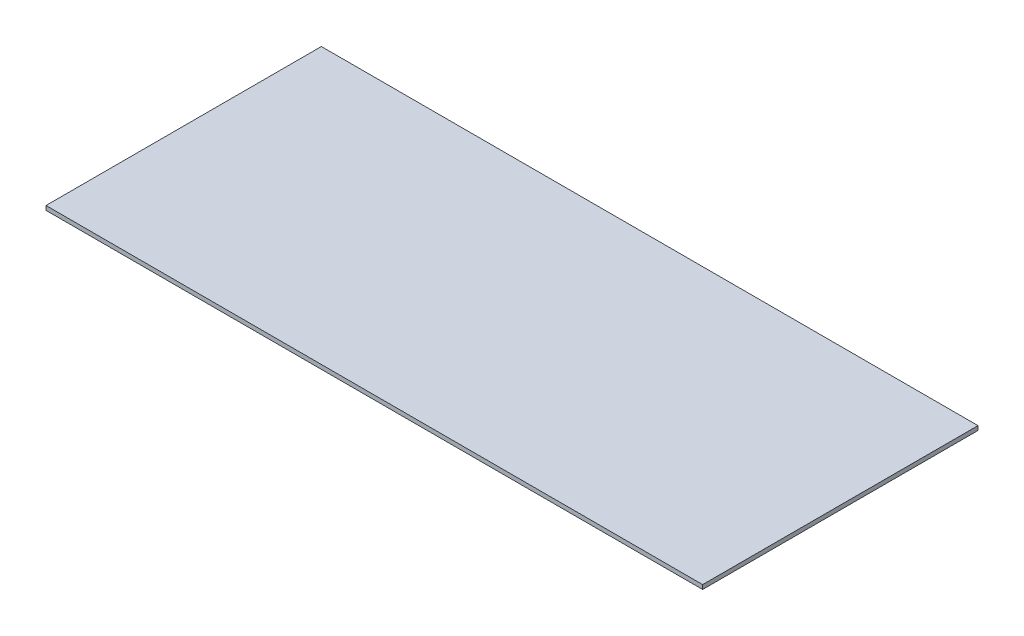
ISO-10303-21;
HEADER;
FILE_DESCRIPTION(('STEP AP214'),'2;1');
FILE_NAME('part.step','',(''),(''),'','','');
FILE_SCHEMA(('AUTOMOTIVE_DESIGN { 1 0 10303 214 1 1 1 1 }'));
ENDSEC;
DATA;
#1=APPLICATION_CONTEXT('core data for automotive mechanical design processes');
#2=APPLICATION_PROTOCOL_DEFINITION('international standard','automotive_design',2000,#1);
#3=PRODUCT_CONTEXT('',#1,'mechanical');
#4=PRODUCT('Part','Part','',(#3));
#5=PRODUCT_RELATED_PRODUCT_CATEGORY('part','',(#4));
#6=PRODUCT_DEFINITION_FORMATION('','',#4);
#7=PRODUCT_DEFINITION_CONTEXT('part definition',#1,'design');
#8=PRODUCT_DEFINITION('design','',#6,#7);
#9=PRODUCT_DEFINITION_SHAPE('','',#8);
#10=(LENGTH_UNIT() NAMED_UNIT(*) SI_UNIT(.MILLI.,.METRE.));
#11=(NAMED_UNIT(*) PLANE_ANGLE_UNIT() SI_UNIT($,.RADIAN.));
#12=(NAMED_UNIT(*) SI_UNIT($,.STERADIAN.) SOLID_ANGLE_UNIT());
#13=UNCERTAINTY_MEASURE_WITH_UNIT(LENGTH_MEASURE(1.E-05),#10,'distance_accuracy_value','');
#14=(GEOMETRIC_REPRESENTATION_CONTEXT(3) GLOBAL_UNCERTAINTY_ASSIGNED_CONTEXT((#13)) GLOBAL_UNIT_ASSIGNED_CONTEXT((#10,
#11,#12)) REPRESENTATION_CONTEXT('',''));
#15=CARTESIAN_POINT('',(0.,0.,0.));
#16=DIRECTION('',(0.,0.,1.));
#17=DIRECTION('',(1.,0.,0.));
#18=AXIS2_PLACEMENT_3D('',#15,#16,#17);
#19=CARTESIAN_POINT('',(0.,-2.,0.));
#20=DIRECTION('',(0.,-1.,0.));
#21=DIRECTION('',(0.,0.,-1.));
#22=AXIS2_PLACEMENT_3D('',#19,#20,#21);
#23=PLANE('',#22);
#24=DIRECTION('',(0.,0.,-1.));
#25=VECTOR('',#24,1.);
#26=CARTESIAN_POINT('',(-200.,-2.,0.));
#27=LINE('',#26,#25);
#28=CARTESIAN_POINT('',(-200.,-2.,0.));
#29=VERTEX_POINT('',#28);
#30=CARTESIAN_POINT('',(-200.,-2.,-130.));
#31=VERTEX_POINT('',#30);
#32=EDGE_CURVE('E91',#29,#31,#27,.T.);
#33=ORIENTED_EDGE('',*,*,#32,.T.);
#34=DIRECTION('',(1.,0.,0.));
#35=VECTOR('',#34,1.);
#36=CARTESIAN_POINT('',(-200.,-2.,-130.));
#37=LINE('',#36,#35);
#38=CARTESIAN_POINT('',(110.,-2.00000000000003,-130.));
#39=VERTEX_POINT('',#38);
#40=EDGE_CURVE('E53',#31,#39,#37,.T.);
#41=ORIENTED_EDGE('',*,*,#40,.T.);
#42=DIRECTION('',(0.,0.,1.));
#43=VECTOR('',#42,1.);
#44=CARTESIAN_POINT('',(110.,-2.00000000000003,-130.));
#45=LINE('',#44,#43);
#46=CARTESIAN_POINT('',(110.,-2.00000000000003,0.));
#47=VERTEX_POINT('',#46);
#48=EDGE_CURVE('E77',#39,#47,#45,.T.);
#49=ORIENTED_EDGE('',*,*,#48,.T.);
#50=DIRECTION('',(-1.,0.,0.));
#51=VECTOR('',#50,1.);
#52=CARTESIAN_POINT('',(0.,-2.,0.));
#53=LINE('',#52,#51);
#54=EDGE_CURVE('E35',#47,#29,#53,.T.);
#55=ORIENTED_EDGE('',*,*,#54,.T.);
#56=EDGE_LOOP('',(#33,#41,#49,#55));
#57=FACE_BOUND('',#56,.T.);
#58=ADVANCED_FACE('F18',(#57),#23,.T.);
#59=CARTESIAN_POINT('',(0.,0.,0.));
#60=DIRECTION('',(0.,-1.,0.));
#61=DIRECTION('',(0.,0.,-1.));
#62=AXIS2_PLACEMENT_3D('',#59,#60,#61);
#63=PLANE('',#62);
#64=DIRECTION('',(1.,0.,0.));
#65=VECTOR('',#64,1.);
#66=CARTESIAN_POINT('',(-200.,0.,-130.));
#67=LINE('',#66,#65);
#68=CARTESIAN_POINT('',(-200.,0.,-130.));
#69=VERTEX_POINT('',#68);
#70=CARTESIAN_POINT('',(110.,0.,-130.));
#71=VERTEX_POINT('',#70);
#72=EDGE_CURVE('E62',#69,#71,#67,.T.);
#73=ORIENTED_EDGE('',*,*,#72,.F.);
#74=DIRECTION('',(0.,0.,-1.));
#75=VECTOR('',#74,1.);
#76=CARTESIAN_POINT('',(-200.,0.,0.));
#77=LINE('',#76,#75);
#78=CARTESIAN_POINT('',(-200.,0.,0.));
#79=VERTEX_POINT('',#78);
#80=EDGE_CURVE('E46',#79,#69,#77,.T.);
#81=ORIENTED_EDGE('',*,*,#80,.F.);
#82=DIRECTION('',(-1.,0.,0.));
#83=VECTOR('',#82,1.);
#84=CARTESIAN_POINT('',(0.,0.,0.));
#85=LINE('',#84,#83);
#86=CARTESIAN_POINT('',(110.,0.,0.));
#87=VERTEX_POINT('',#86);
#88=EDGE_CURVE('E70',#87,#79,#85,.T.);
#89=ORIENTED_EDGE('',*,*,#88,.F.);
#90=DIRECTION('',(0.,0.,1.));
#91=VECTOR('',#90,1.);
#92=CARTESIAN_POINT('',(110.,0.,-130.));
#93=LINE('',#92,#91);
#94=EDGE_CURVE('E76',#71,#87,#93,.T.);
#95=ORIENTED_EDGE('',*,*,#94,.F.);
#96=EDGE_LOOP('',(#73,#81,#89,#95));
#97=FACE_BOUND('',#96,.T.);
#98=ADVANCED_FACE('F80',(#97),#63,.F.);
#99=CARTESIAN_POINT('',(-200.,-2.,0.));
#100=DIRECTION('',(1.,0.,0.));
#101=DIRECTION('',(0.,0.,-1.));
#102=AXIS2_PLACEMENT_3D('',#99,#100,#101);
#103=PLANE('',#102);
#104=DIRECTION('',(0.,1.,0.));
#105=VECTOR('',#104,1.);
#106=CARTESIAN_POINT('',(-200.,-2.,-130.));
#107=LINE('',#106,#105);
#108=EDGE_CURVE('E11',#31,#69,#107,.T.);
#109=ORIENTED_EDGE('',*,*,#108,.F.);
#110=ORIENTED_EDGE('',*,*,#32,.F.);
#111=DIRECTION('',(0.,1.,0.));
#112=VECTOR('',#111,1.);
#113=CARTESIAN_POINT('',(-200.,-2.,0.));
#114=LINE('',#113,#112);
#115=EDGE_CURVE('E27',#29,#79,#114,.T.);
#116=ORIENTED_EDGE('',*,*,#115,.T.);
#117=ORIENTED_EDGE('',*,*,#80,.T.);
#118=EDGE_LOOP('',(#109,#110,#116,#117));
#119=FACE_BOUND('',#118,.T.);
#120=ADVANCED_FACE('F20',(#119),#103,.F.);
#121=CARTESIAN_POINT('',(-200.,-2.,-130.));
#122=DIRECTION('',(0.,0.,1.));
#123=DIRECTION('',(1.,0.,0.));
#124=AXIS2_PLACEMENT_3D('',#121,#122,#123);
#125=PLANE('',#124);
#126=ORIENTED_EDGE('',*,*,#72,.T.);
#127=DIRECTION('',(0.,1.,0.));
#128=VECTOR('',#127,1.);
#129=CARTESIAN_POINT('',(110.,-2.00000000000003,-130.));
#130=LINE('',#129,#128);
#131=EDGE_CURVE('E65',#39,#71,#130,.T.);
#132=ORIENTED_EDGE('',*,*,#131,.F.);
#133=ORIENTED_EDGE('',*,*,#40,.F.);
#134=ORIENTED_EDGE('',*,*,#108,.T.);
#135=EDGE_LOOP('',(#126,#132,#133,#134));
#136=FACE_BOUND('',#135,.T.);
#137=ADVANCED_FACE('F64',(#136),#125,.F.);
#138=CARTESIAN_POINT('',(0.,-2.,0.));
#139=DIRECTION('',(0.,0.,-1.));
#140=DIRECTION('',(-1.,0.,0.));
#141=AXIS2_PLACEMENT_3D('',#138,#139,#140);
#142=PLANE('',#141);
#143=ORIENTED_EDGE('',*,*,#88,.T.);
#144=ORIENTED_EDGE('',*,*,#115,.F.);
#145=ORIENTED_EDGE('',*,*,#54,.F.);
#146=DIRECTION('',(0.,1.,0.));
#147=VECTOR('',#146,1.);
#148=CARTESIAN_POINT('',(110.,-2.00000000000003,0.));
#149=LINE('',#148,#147);
#150=EDGE_CURVE('E78',#47,#87,#149,.T.);
#151=ORIENTED_EDGE('',*,*,#150,.T.);
#152=EDGE_LOOP('',(#143,#144,#145,#151));
#153=FACE_BOUND('',#152,.T.);
#154=ADVANCED_FACE('F98',(#153),#142,.F.);
#155=CARTESIAN_POINT('',(110.,-2.00000000000003,-130.));
#156=DIRECTION('',(-1.,0.,0.));
#157=DIRECTION('',(0.,0.,1.));
#158=AXIS2_PLACEMENT_3D('',#155,#156,#157);
#159=PLANE('',#158);
#160=ORIENTED_EDGE('',*,*,#94,.T.);
#161=ORIENTED_EDGE('',*,*,#150,.F.);
#162=ORIENTED_EDGE('',*,*,#48,.F.);
#163=ORIENTED_EDGE('',*,*,#131,.T.);
#164=EDGE_LOOP('',(#160,#161,#162,#163));
#165=FACE_BOUND('',#164,.T.);
#166=ADVANCED_FACE('F74',(#165),#159,.F.);
#167=CLOSED_SHELL('',(#58,#98,#120,#137,#154,#166));
#168=MANIFOLD_SOLID_BREP('B1',#167);
#169=ADVANCED_BREP_SHAPE_REPRESENTATION('',(#18,#168),#14);
#170=SHAPE_DEFINITION_REPRESENTATION(#9,#169);
ENDSEC;
END-ISO-10303-21;
